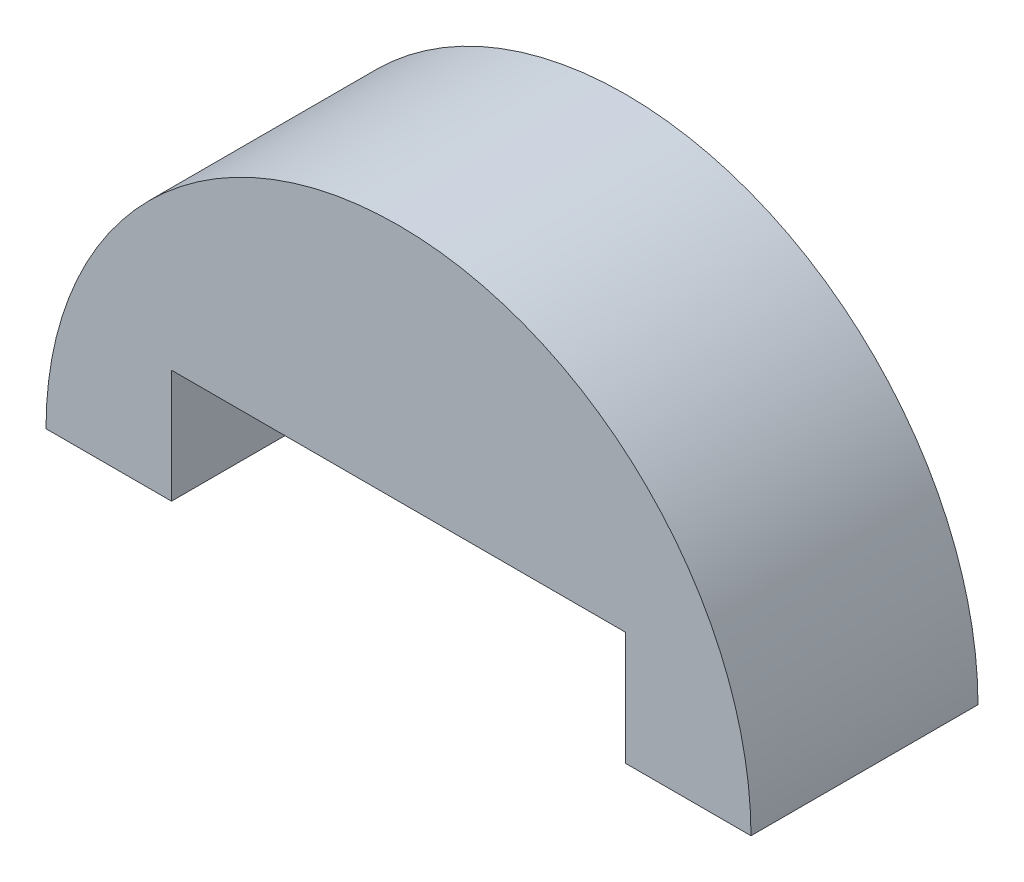
ISO-10303-21;
HEADER;
FILE_DESCRIPTION(('STEP AP214'),'2;1');
FILE_NAME('part.step','',(''),(''),'','','');
FILE_SCHEMA(('AUTOMOTIVE_DESIGN { 1 0 10303 214 1 1 1 1 }'));
ENDSEC;
DATA;
#1=APPLICATION_CONTEXT('core data for automotive mechanical design processes');
#2=APPLICATION_PROTOCOL_DEFINITION('international standard','automotive_design',2000,#1);
#3=PRODUCT_CONTEXT('',#1,'mechanical');
#4=PRODUCT('Part','Part','',(#3));
#5=PRODUCT_RELATED_PRODUCT_CATEGORY('part','',(#4));
#6=PRODUCT_DEFINITION_FORMATION('','',#4);
#7=PRODUCT_DEFINITION_CONTEXT('part definition',#1,'design');
#8=PRODUCT_DEFINITION('design','',#6,#7);
#9=PRODUCT_DEFINITION_SHAPE('','',#8);
#10=(LENGTH_UNIT() NAMED_UNIT(*) SI_UNIT(.MILLI.,.METRE.));
#11=(NAMED_UNIT(*) PLANE_ANGLE_UNIT() SI_UNIT($,.RADIAN.));
#12=(NAMED_UNIT(*) SI_UNIT($,.STERADIAN.) SOLID_ANGLE_UNIT());
#13=UNCERTAINTY_MEASURE_WITH_UNIT(LENGTH_MEASURE(1.E-05),#10,'distance_accuracy_value','');
#14=(GEOMETRIC_REPRESENTATION_CONTEXT(3) GLOBAL_UNCERTAINTY_ASSIGNED_CONTEXT((#13)) GLOBAL_UNIT_ASSIGNED_CONTEXT((#10,
#11,#12)) REPRESENTATION_CONTEXT('',''));
#15=CARTESIAN_POINT('',(0.,0.,0.));
#16=DIRECTION('',(0.,0.,1.));
#17=DIRECTION('',(1.,0.,0.));
#18=AXIS2_PLACEMENT_3D('',#15,#16,#17);
#19=CARTESIAN_POINT('',(3567.63628005391,1325.38091889489,6.));
#20=DIRECTION('',(0.,1.,0.));
#21=DIRECTION('',(0.,0.,1.));
#22=AXIS2_PLACEMENT_3D('',#19,#20,#21);
#23=PLANE('',#22);
#24=DIRECTION('',(1.,0.,0.));
#25=VECTOR('',#24,1.);
#26=CARTESIAN_POINT('',(3567.63628005391,1325.38091889489,0.));
#27=LINE('',#26,#25);
#28=CARTESIAN_POINT('',(3567.63628005391,1325.38091889489,0.));
#29=VERTEX_POINT('',#28);
#30=CARTESIAN_POINT('',(3570.95335761974,1325.38091889489,0.));
#31=VERTEX_POINT('',#30);
#32=EDGE_CURVE('E129',#29,#31,#27,.T.);
#33=ORIENTED_EDGE('',*,*,#32,.T.);
#34=DIRECTION('',(0.,0.,-1.));
#35=VECTOR('',#34,1.);
#36=CARTESIAN_POINT('',(3570.95335761974,1325.38091889489,6.));
#37=LINE('',#36,#35);
#38=CARTESIAN_POINT('',(3570.95335761974,1325.38091889489,6.));
#39=VERTEX_POINT('',#38);
#40=EDGE_CURVE('E11',#39,#31,#37,.T.);
#41=ORIENTED_EDGE('',*,*,#40,.F.);
#42=DIRECTION('',(1.,0.,0.));
#43=VECTOR('',#42,1.);
#44=CARTESIAN_POINT('',(3567.63628005391,1325.38091889489,6.));
#45=LINE('',#44,#43);
#46=CARTESIAN_POINT('',(3567.63628005391,1325.38091889489,6.));
#47=VERTEX_POINT('',#46);
#48=EDGE_CURVE('E146',#47,#39,#45,.T.);
#49=ORIENTED_EDGE('',*,*,#48,.F.);
#50=DIRECTION('',(0.,0.,-1.));
#51=VECTOR('',#50,1.);
#52=CARTESIAN_POINT('',(3567.63628005391,1325.38091889489,6.));
#53=LINE('',#52,#51);
#54=EDGE_CURVE('E128',#47,#29,#53,.T.);
#55=ORIENTED_EDGE('',*,*,#54,.T.);
#56=EDGE_LOOP('',(#33,#41,#49,#55));
#57=FACE_BOUND('',#56,.T.);
#58=ADVANCED_FACE('F39',(#57),#23,.F.);
#59=CARTESIAN_POINT('',(3561.63628005391,1325.38091889489,6.));
#60=DIRECTION('',(0.,0.,-1.));
#61=DIRECTION('',(-1.,0.,0.));
#62=AXIS2_PLACEMENT_3D('',#59,#60,#61);
#63=CYLINDRICAL_SURFACE('',#62,9.31707756582179);
#64=CARTESIAN_POINT('',(3561.63628005391,1325.38091889489,0.));
#65=DIRECTION('',(0.,0.,1.));
#66=DIRECTION('',(1.,0.,0.));
#67=AXIS2_PLACEMENT_3D('',#64,#65,#66);
#68=CIRCLE('',#67,9.31707756582179);
#69=CARTESIAN_POINT('',(3552.31920248809,1325.38091889489,0.));
#70=VERTEX_POINT('',#69);
#71=EDGE_CURVE('E133',#31,#70,#68,.T.);
#72=ORIENTED_EDGE('',*,*,#71,.T.);
#73=DIRECTION('',(0.,0.,-1.));
#74=VECTOR('',#73,1.);
#75=CARTESIAN_POINT('',(3552.31920248809,1325.38091889489,6.));
#76=LINE('',#75,#74);
#77=CARTESIAN_POINT('',(3552.31920248809,1325.38091889489,6.));
#78=VERTEX_POINT('',#77);
#79=EDGE_CURVE('E48',#78,#70,#76,.T.);
#80=ORIENTED_EDGE('',*,*,#79,.F.);
#81=CARTESIAN_POINT('',(3561.63628005391,1325.38091889489,6.));
#82=DIRECTION('',(0.,0.,1.));
#83=DIRECTION('',(1.,0.,0.));
#84=AXIS2_PLACEMENT_3D('',#81,#82,#83);
#85=CIRCLE('',#84,9.31707756582179);
#86=EDGE_CURVE('E92',#39,#78,#85,.T.);
#87=ORIENTED_EDGE('',*,*,#86,.F.);
#88=ORIENTED_EDGE('',*,*,#40,.T.);
#89=EDGE_LOOP('',(#72,#80,#87,#88));
#90=FACE_BOUND('',#89,.T.);
#91=ADVANCED_FACE('F174',(#90),#63,.T.);
#92=CARTESIAN_POINT('',(3552.31920248809,1325.38091889489,6.));
#93=DIRECTION('',(0.,1.,0.));
#94=DIRECTION('',(0.,0.,1.));
#95=AXIS2_PLACEMENT_3D('',#92,#93,#94);
#96=PLANE('',#95);
#97=DIRECTION('',(1.,0.,0.));
#98=VECTOR('',#97,1.);
#99=CARTESIAN_POINT('',(3552.31920248809,1325.38091889489,0.));
#100=LINE('',#99,#98);
#101=CARTESIAN_POINT('',(3555.63628005391,1325.38091889489,0.));
#102=VERTEX_POINT('',#101);
#103=EDGE_CURVE('E136',#70,#102,#100,.T.);
#104=ORIENTED_EDGE('',*,*,#103,.T.);
#105=DIRECTION('',(0.,0.,-1.));
#106=VECTOR('',#105,1.);
#107=CARTESIAN_POINT('',(3555.63628005391,1325.38091889489,6.));
#108=LINE('',#107,#106);
#109=CARTESIAN_POINT('',(3555.63628005391,1325.38091889489,6.));
#110=VERTEX_POINT('',#109);
#111=EDGE_CURVE('E109',#110,#102,#108,.T.);
#112=ORIENTED_EDGE('',*,*,#111,.F.);
#113=DIRECTION('',(1.,0.,0.));
#114=VECTOR('',#113,1.);
#115=CARTESIAN_POINT('',(3552.31920248809,1325.38091889489,6.));
#116=LINE('',#115,#114);
#117=EDGE_CURVE('E118',#78,#110,#116,.T.);
#118=ORIENTED_EDGE('',*,*,#117,.F.);
#119=ORIENTED_EDGE('',*,*,#79,.T.);
#120=EDGE_LOOP('',(#104,#112,#118,#119));
#121=FACE_BOUND('',#120,.T.);
#122=ADVANCED_FACE('F156',(#121),#96,.F.);
#123=CARTESIAN_POINT('',(3555.63628005391,1328.38091889489,6.));
#124=DIRECTION('',(1.,0.,0.));
#125=DIRECTION('',(0.,0.,-1.));
#126=AXIS2_PLACEMENT_3D('',#123,#124,#125);
#127=PLANE('',#126);
#128=DIRECTION('',(0.,-1.,0.));
#129=VECTOR('',#128,1.);
#130=CARTESIAN_POINT('',(3555.63628005391,1328.38091889489,0.));
#131=LINE('',#130,#129);
#132=CARTESIAN_POINT('',(3555.63628005391,1328.38091889489,0.));
#133=VERTEX_POINT('',#132);
#134=EDGE_CURVE('E107',#133,#102,#131,.T.);
#135=ORIENTED_EDGE('',*,*,#134,.F.);
#136=DIRECTION('',(0.,0.,-1.));
#137=VECTOR('',#136,1.);
#138=CARTESIAN_POINT('',(3555.63628005391,1328.38091889489,6.));
#139=LINE('',#138,#137);
#140=CARTESIAN_POINT('',(3555.63628005391,1328.38091889489,6.));
#141=VERTEX_POINT('',#140);
#142=EDGE_CURVE('E101',#141,#133,#139,.T.);
#143=ORIENTED_EDGE('',*,*,#142,.F.);
#144=DIRECTION('',(0.,-1.,0.));
#145=VECTOR('',#144,1.);
#146=CARTESIAN_POINT('',(3555.63628005391,1328.38091889489,6.));
#147=LINE('',#146,#145);
#148=EDGE_CURVE('E105',#141,#110,#147,.T.);
#149=ORIENTED_EDGE('',*,*,#148,.T.);
#150=ORIENTED_EDGE('',*,*,#111,.T.);
#151=EDGE_LOOP('',(#135,#143,#149,#150));
#152=FACE_BOUND('',#151,.T.);
#153=ADVANCED_FACE('F103',(#152),#127,.T.);
#154=CARTESIAN_POINT('',(3555.63628005391,1328.38091889489,6.));
#155=DIRECTION('',(0.,1.,0.));
#156=DIRECTION('',(0.,0.,1.));
#157=AXIS2_PLACEMENT_3D('',#154,#155,#156);
#158=PLANE('',#157);
#159=DIRECTION('',(1.,0.,0.));
#160=VECTOR('',#159,1.);
#161=CARTESIAN_POINT('',(3555.63628005391,1328.38091889489,0.));
#162=LINE('',#161,#160);
#163=CARTESIAN_POINT('',(3567.63628005391,1328.38091889489,0.));
#164=VERTEX_POINT('',#163);
#165=EDGE_CURVE('E78',#133,#164,#162,.T.);
#166=ORIENTED_EDGE('',*,*,#165,.T.);
#167=DIRECTION('',(0.,0.,-1.));
#168=VECTOR('',#167,1.);
#169=CARTESIAN_POINT('',(3567.63628005391,1328.38091889489,6.));
#170=LINE('',#169,#168);
#171=CARTESIAN_POINT('',(3567.63628005391,1328.38091889489,6.));
#172=VERTEX_POINT('',#171);
#173=EDGE_CURVE('E110',#172,#164,#170,.T.);
#174=ORIENTED_EDGE('',*,*,#173,.F.);
#175=DIRECTION('',(1.,0.,0.));
#176=VECTOR('',#175,1.);
#177=CARTESIAN_POINT('',(3555.63628005391,1328.38091889489,6.));
#178=LINE('',#177,#176);
#179=EDGE_CURVE('E112',#141,#172,#178,.T.);
#180=ORIENTED_EDGE('',*,*,#179,.F.);
#181=ORIENTED_EDGE('',*,*,#142,.T.);
#182=EDGE_LOOP('',(#166,#174,#180,#181));
#183=FACE_BOUND('',#182,.T.);
#184=ADVANCED_FACE('F113',(#183),#158,.F.);
#185=CARTESIAN_POINT('',(3567.63628005391,1328.38091889489,6.));
#186=DIRECTION('',(1.,0.,0.));
#187=DIRECTION('',(0.,0.,-1.));
#188=AXIS2_PLACEMENT_3D('',#185,#186,#187);
#189=PLANE('',#188);
#190=DIRECTION('',(0.,-1.,0.));
#191=VECTOR('',#190,1.);
#192=CARTESIAN_POINT('',(3567.63628005391,1328.38091889489,0.));
#193=LINE('',#192,#191);
#194=EDGE_CURVE('E84',#164,#29,#193,.T.);
#195=ORIENTED_EDGE('',*,*,#194,.T.);
#196=ORIENTED_EDGE('',*,*,#54,.F.);
#197=DIRECTION('',(0.,-1.,0.));
#198=VECTOR('',#197,1.);
#199=CARTESIAN_POINT('',(3567.63628005391,1328.38091889489,6.));
#200=LINE('',#199,#198);
#201=EDGE_CURVE('E56',#172,#47,#200,.T.);
#202=ORIENTED_EDGE('',*,*,#201,.F.);
#203=ORIENTED_EDGE('',*,*,#173,.T.);
#204=EDGE_LOOP('',(#195,#196,#202,#203));
#205=FACE_BOUND('',#204,.T.);
#206=ADVANCED_FACE('F163',(#205),#189,.F.);
#207=CARTESIAN_POINT('',(3561.63628005391,1325.38091889489,6.));
#208=DIRECTION('',(0.,0.,1.));
#209=DIRECTION('',(1.,0.,0.));
#210=AXIS2_PLACEMENT_3D('',#207,#208,#209);
#211=PLANE('',#210);
#212=ORIENTED_EDGE('',*,*,#48,.T.);
#213=ORIENTED_EDGE('',*,*,#86,.T.);
#214=ORIENTED_EDGE('',*,*,#117,.T.);
#215=ORIENTED_EDGE('',*,*,#148,.F.);
#216=ORIENTED_EDGE('',*,*,#179,.T.);
#217=ORIENTED_EDGE('',*,*,#201,.T.);
#218=EDGE_LOOP('',(#212,#213,#214,#215,#216,#217));
#219=FACE_BOUND('',#218,.T.);
#220=ADVANCED_FACE('F116',(#219),#211,.T.);
#221=CARTESIAN_POINT('',(3561.63628005391,1325.38091889489,0.));
#222=DIRECTION('',(0.,0.,1.));
#223=DIRECTION('',(1.,0.,0.));
#224=AXIS2_PLACEMENT_3D('',#221,#222,#223);
#225=PLANE('',#224);
#226=ORIENTED_EDGE('',*,*,#32,.F.);
#227=ORIENTED_EDGE('',*,*,#194,.F.);
#228=ORIENTED_EDGE('',*,*,#165,.F.);
#229=ORIENTED_EDGE('',*,*,#134,.T.);
#230=ORIENTED_EDGE('',*,*,#103,.F.);
#231=ORIENTED_EDGE('',*,*,#71,.F.);
#232=EDGE_LOOP('',(#226,#227,#228,#229,#230,#231));
#233=FACE_BOUND('',#232,.T.);
#234=ADVANCED_FACE('F159',(#233),#225,.F.);
#235=CLOSED_SHELL('',(#58,#91,#122,#153,#184,#206,#220,#234));
#236=MANIFOLD_SOLID_BREP('B2',#235);
#237=ADVANCED_BREP_SHAPE_REPRESENTATION('',(#18,#236),#14);
#238=SHAPE_DEFINITION_REPRESENTATION(#9,#237);
ENDSEC;
END-ISO-10303-21;
